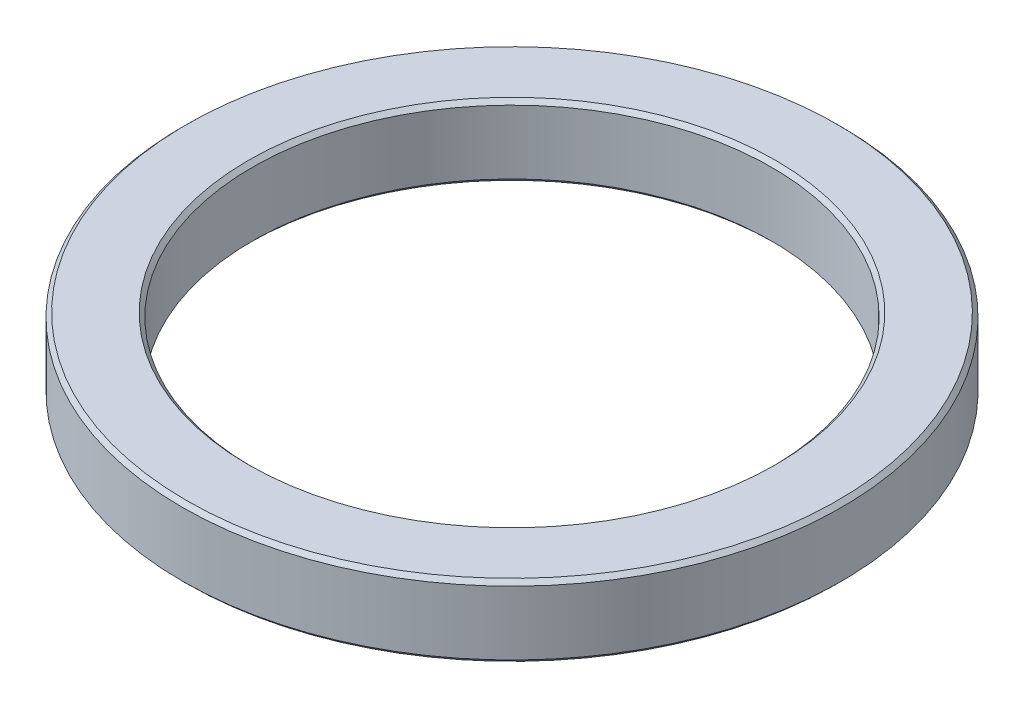
ISO-10303-21;
HEADER;
FILE_DESCRIPTION(('STEP AP214'),'2;1');
FILE_NAME('part.step','',(''),(''),'','','');
FILE_SCHEMA(('AUTOMOTIVE_DESIGN { 1 0 10303 214 1 1 1 1 }'));
ENDSEC;
DATA;
#1=APPLICATION_CONTEXT('core data for automotive mechanical design processes');
#2=APPLICATION_PROTOCOL_DEFINITION('international standard','automotive_design',2000,#1);
#3=PRODUCT_CONTEXT('',#1,'mechanical');
#4=PRODUCT('Part','Part','',(#3));
#5=PRODUCT_RELATED_PRODUCT_CATEGORY('part','',(#4));
#6=PRODUCT_DEFINITION_FORMATION('','',#4);
#7=PRODUCT_DEFINITION_CONTEXT('part definition',#1,'design');
#8=PRODUCT_DEFINITION('design','',#6,#7);
#9=PRODUCT_DEFINITION_SHAPE('','',#8);
#10=(LENGTH_UNIT() NAMED_UNIT(*) SI_UNIT(.MILLI.,.METRE.));
#11=(NAMED_UNIT(*) PLANE_ANGLE_UNIT() SI_UNIT($,.RADIAN.));
#12=(NAMED_UNIT(*) SI_UNIT($,.STERADIAN.) SOLID_ANGLE_UNIT());
#13=UNCERTAINTY_MEASURE_WITH_UNIT(LENGTH_MEASURE(1.E-05),#10,'distance_accuracy_value','');
#14=(GEOMETRIC_REPRESENTATION_CONTEXT(3) GLOBAL_UNCERTAINTY_ASSIGNED_CONTEXT((#13)) GLOBAL_UNIT_ASSIGNED_CONTEXT((#10,
#11,#12)) REPRESENTATION_CONTEXT('',''));
#15=CARTESIAN_POINT('',(0.,0.,0.));
#16=DIRECTION('',(0.,0.,1.));
#17=DIRECTION('',(1.,0.,0.));
#18=AXIS2_PLACEMENT_3D('',#15,#16,#17);
#19=CARTESIAN_POINT('',(0.,18.,0.));
#20=DIRECTION('',(0.,1.,0.));
#21=DIRECTION('',(0.,0.,1.));
#22=AXIS2_PLACEMENT_3D('',#19,#20,#21);
#23=PLANE('',#22);
#24=CARTESIAN_POINT('',(0.,18.,0.));
#25=DIRECTION('',(0.,1.,0.));
#26=DIRECTION('',(0.,0.,1.));
#27=AXIS2_PLACEMENT_3D('',#24,#25,#26);
#28=CIRCLE('',#27,81.5);
#29=CARTESIAN_POINT('',(0.,18.,81.5));
#30=VERTEX_POINT('',#29);
#31=EDGE_CURVE('E47',#30,#30,#28,.T.);
#32=ORIENTED_EDGE('',*,*,#31,.T.);
#33=EDGE_LOOP('',(#32));
#34=FACE_BOUND('',#33,.T.);
#35=CARTESIAN_POINT('',(0.,18.,0.));
#36=DIRECTION('',(0.,1.,0.));
#37=DIRECTION('',(0.,0.,1.));
#38=AXIS2_PLACEMENT_3D('',#35,#36,#37);
#39=CIRCLE('',#38,66.0000000000001);
#40=CARTESIAN_POINT('',(0.,18.,66.0000000000001));
#41=VERTEX_POINT('',#40);
#42=EDGE_CURVE('E51',#41,#41,#39,.F.);
#43=ORIENTED_EDGE('',*,*,#42,.T.);
#44=EDGE_LOOP('',(#43));
#45=FACE_BOUND('',#44,.T.);
#46=ADVANCED_FACE('F35',(#34,#45),#23,.T.);
#47=CARTESIAN_POINT('',(0.,0.,0.));
#48=DIRECTION('',(0.,1.,0.));
#49=DIRECTION('',(0.,0.,1.));
#50=AXIS2_PLACEMENT_3D('',#47,#48,#49);
#51=PLANE('',#50);
#52=CARTESIAN_POINT('',(0.,0.,0.));
#53=DIRECTION('',(0.,1.,0.));
#54=DIRECTION('',(0.,0.,1.));
#55=AXIS2_PLACEMENT_3D('',#52,#53,#54);
#56=CIRCLE('',#55,81.5);
#57=CARTESIAN_POINT('',(0.,0.,81.5));
#58=VERTEX_POINT('',#57);
#59=EDGE_CURVE('E56',#58,#58,#56,.F.);
#60=ORIENTED_EDGE('',*,*,#59,.T.);
#61=EDGE_LOOP('',(#60));
#62=FACE_BOUND('',#61,.T.);
#63=CARTESIAN_POINT('',(0.,0.,0.));
#64=DIRECTION('',(0.,1.,0.));
#65=DIRECTION('',(0.,0.,1.));
#66=AXIS2_PLACEMENT_3D('',#63,#64,#65);
#67=CIRCLE('',#66,66.);
#68=CARTESIAN_POINT('',(0.,0.,66.));
#69=VERTEX_POINT('',#68);
#70=EDGE_CURVE('E59',#69,#69,#67,.T.);
#71=ORIENTED_EDGE('',*,*,#70,.T.);
#72=EDGE_LOOP('',(#71));
#73=FACE_BOUND('',#72,.T.);
#74=ADVANCED_FACE('F81',(#62,#73),#51,.F.);
#75=CARTESIAN_POINT('',(0.,18.,0.));
#76=DIRECTION('',(0.,-1.,0.));
#77=DIRECTION('',(0.,0.,-1.));
#78=AXIS2_PLACEMENT_3D('',#75,#76,#77);
#79=CYLINDRICAL_SURFACE('',#78,82.5);
#80=CARTESIAN_POINT('',(0.,1.,0.));
#81=DIRECTION('',(0.,1.,0.));
#82=DIRECTION('',(0.,0.,1.));
#83=AXIS2_PLACEMENT_3D('',#80,#81,#82);
#84=CIRCLE('',#83,82.5);
#85=CARTESIAN_POINT('',(0.,1.,82.5));
#86=VERTEX_POINT('',#85);
#87=EDGE_CURVE('E62',#86,#86,#84,.T.);
#88=ORIENTED_EDGE('',*,*,#87,.T.);
#89=EDGE_LOOP('',(#88));
#90=FACE_BOUND('',#89,.T.);
#91=CARTESIAN_POINT('',(0.,17.,0.));
#92=DIRECTION('',(0.,1.,0.));
#93=DIRECTION('',(0.,0.,1.));
#94=AXIS2_PLACEMENT_3D('',#91,#92,#93);
#95=CIRCLE('',#94,82.5);
#96=CARTESIAN_POINT('',(0.,17.,82.5));
#97=VERTEX_POINT('',#96);
#98=EDGE_CURVE('E65',#97,#97,#95,.F.);
#99=ORIENTED_EDGE('',*,*,#98,.T.);
#100=EDGE_LOOP('',(#99));
#101=FACE_BOUND('',#100,.T.);
#102=ADVANCED_FACE('F69',(#90,#101),#79,.T.);
#103=CARTESIAN_POINT('',(0.,18.,0.));
#104=DIRECTION('',(0.,-1.,0.));
#105=DIRECTION('',(0.,0.,-1.));
#106=AXIS2_PLACEMENT_3D('',#103,#104,#105);
#107=CYLINDRICAL_SURFACE('',#106,65.);
#108=CARTESIAN_POINT('',(0.,0.999999999999987,0.));
#109=DIRECTION('',(0.,1.,0.));
#110=DIRECTION('',(0.,0.,1.));
#111=AXIS2_PLACEMENT_3D('',#108,#109,#110);
#112=CIRCLE('',#111,65.);
#113=CARTESIAN_POINT('',(0.,0.999999999999987,65.));
#114=VERTEX_POINT('',#113);
#115=EDGE_CURVE('E10',#114,#114,#112,.F.);
#116=ORIENTED_EDGE('',*,*,#115,.T.);
#117=EDGE_LOOP('',(#116));
#118=FACE_BOUND('',#117,.T.);
#119=CARTESIAN_POINT('',(0.,16.9999999999999,0.));
#120=DIRECTION('',(0.,1.,0.));
#121=DIRECTION('',(0.,0.,1.));
#122=AXIS2_PLACEMENT_3D('',#119,#120,#121);
#123=CIRCLE('',#122,65.);
#124=CARTESIAN_POINT('',(0.,16.9999999999999,65.));
#125=VERTEX_POINT('',#124);
#126=EDGE_CURVE('E43',#125,#125,#123,.T.);
#127=ORIENTED_EDGE('',*,*,#126,.T.);
#128=EDGE_LOOP('',(#127));
#129=FACE_BOUND('',#128,.T.);
#130=ADVANCED_FACE('F106',(#118,#129),#107,.F.);
#131=CARTESIAN_POINT('',(0.,1.,0.));
#132=DIRECTION('',(0.,1.,0.));
#133=DIRECTION('',(0.,0.,1.));
#134=AXIS2_PLACEMENT_3D('',#131,#132,#133);
#135=CONICAL_SURFACE('',#134,82.5,0.785398163397448);
#136=ORIENTED_EDGE('',*,*,#59,.F.);
#137=EDGE_LOOP('',(#136));
#138=FACE_BOUND('',#137,.T.);
#139=ORIENTED_EDGE('',*,*,#87,.F.);
#140=EDGE_LOOP('',(#139));
#141=FACE_BOUND('',#140,.T.);
#142=ADVANCED_FACE('F75',(#138,#141),#135,.T.);
#143=CARTESIAN_POINT('',(0.,18.,0.));
#144=DIRECTION('',(0.,-1.,0.));
#145=DIRECTION('',(0.,0.,-1.));
#146=AXIS2_PLACEMENT_3D('',#143,#144,#145);
#147=CONICAL_SURFACE('',#146,81.5,0.785398163397455);
#148=ORIENTED_EDGE('',*,*,#98,.F.);
#149=EDGE_LOOP('',(#148));
#150=FACE_BOUND('',#149,.T.);
#151=ORIENTED_EDGE('',*,*,#31,.F.);
#152=EDGE_LOOP('',(#151));
#153=FACE_BOUND('',#152,.T.);
#154=ADVANCED_FACE('F71',(#150,#153),#147,.T.);
#155=CARTESIAN_POINT('',(0.,0.,0.));
#156=DIRECTION('',(0.,-1.,0.));
#157=DIRECTION('',(0.,0.,-1.));
#158=AXIS2_PLACEMENT_3D('',#155,#156,#157);
#159=CONICAL_SURFACE('',#158,66.,0.785398163397441);
#160=ORIENTED_EDGE('',*,*,#115,.F.);
#161=EDGE_LOOP('',(#160));
#162=FACE_BOUND('',#161,.T.);
#163=ORIENTED_EDGE('',*,*,#70,.F.);
#164=EDGE_LOOP('',(#163));
#165=FACE_BOUND('',#164,.T.);
#166=ADVANCED_FACE('F74',(#162,#165),#159,.F.);
#167=CARTESIAN_POINT('',(0.,16.9999999999999,0.));
#168=DIRECTION('',(0.,1.,0.));
#169=DIRECTION('',(0.,0.,1.));
#170=AXIS2_PLACEMENT_3D('',#167,#168,#169);
#171=CONICAL_SURFACE('',#170,65.,0.785398163397448);
#172=ORIENTED_EDGE('',*,*,#42,.F.);
#173=EDGE_LOOP('',(#172));
#174=FACE_BOUND('',#173,.T.);
#175=ORIENTED_EDGE('',*,*,#126,.F.);
#176=EDGE_LOOP('',(#175));
#177=FACE_BOUND('',#176,.T.);
#178=ADVANCED_FACE('F38',(#174,#177),#171,.F.);
#179=CLOSED_SHELL('',(#46,#74,#102,#130,#142,#154,#166,#178));
#180=MANIFOLD_SOLID_BREP('B2',#179);
#181=ADVANCED_BREP_SHAPE_REPRESENTATION('',(#18,#180),#14);
#182=SHAPE_DEFINITION_REPRESENTATION(#9,#181);
ENDSEC;
END-ISO-10303-21;
